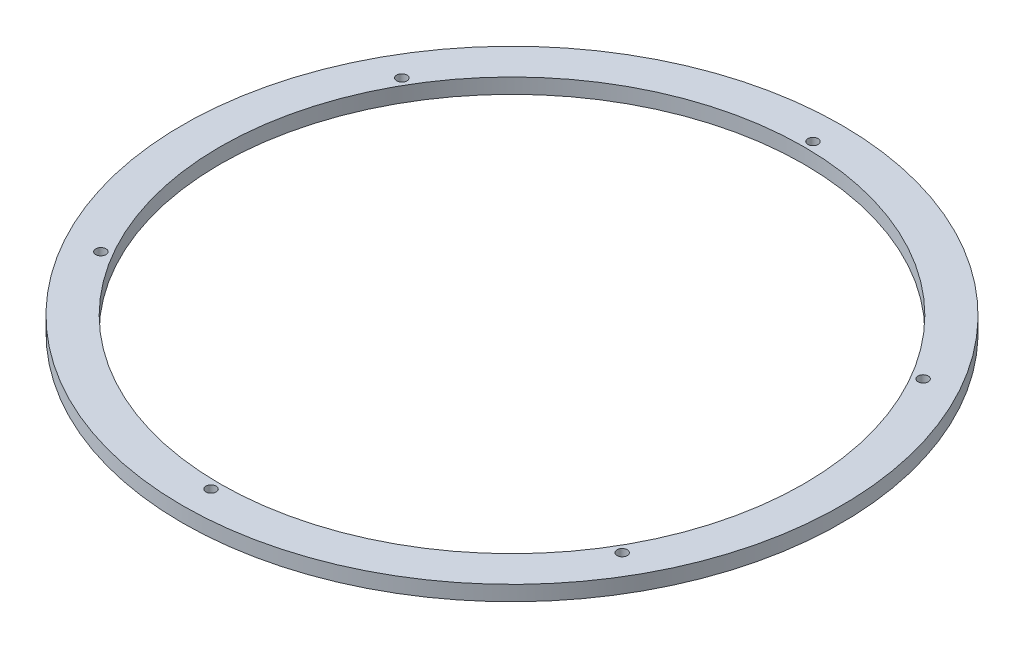
ISO-10303-21;
HEADER;
FILE_DESCRIPTION(('STEP AP214'),'2;1');
FILE_NAME('part.step','',(''),(''),'','','');
FILE_SCHEMA(('AUTOMOTIVE_DESIGN { 1 0 10303 214 1 1 1 1 }'));
ENDSEC;
DATA;
#1=APPLICATION_CONTEXT('core data for automotive mechanical design processes');
#2=APPLICATION_PROTOCOL_DEFINITION('international standard','automotive_design',2000,#1);
#3=PRODUCT_CONTEXT('',#1,'mechanical');
#4=PRODUCT('Part','Part','',(#3));
#5=PRODUCT_RELATED_PRODUCT_CATEGORY('part','',(#4));
#6=PRODUCT_DEFINITION_FORMATION('','',#4);
#7=PRODUCT_DEFINITION_CONTEXT('part definition',#1,'design');
#8=PRODUCT_DEFINITION('design','',#6,#7);
#9=PRODUCT_DEFINITION_SHAPE('','',#8);
#10=(LENGTH_UNIT() NAMED_UNIT(*) SI_UNIT(.MILLI.,.METRE.));
#11=(NAMED_UNIT(*) PLANE_ANGLE_UNIT() SI_UNIT($,.RADIAN.));
#12=(NAMED_UNIT(*) SI_UNIT($,.STERADIAN.) SOLID_ANGLE_UNIT());
#13=UNCERTAINTY_MEASURE_WITH_UNIT(LENGTH_MEASURE(1.E-05),#10,'distance_accuracy_value','');
#14=(GEOMETRIC_REPRESENTATION_CONTEXT(3) GLOBAL_UNCERTAINTY_ASSIGNED_CONTEXT((#13)) GLOBAL_UNIT_ASSIGNED_CONTEXT((#10,
#11,#12)) REPRESENTATION_CONTEXT('',''));
#15=CARTESIAN_POINT('',(0.,0.,0.));
#16=DIRECTION('',(0.,0.,1.));
#17=DIRECTION('',(1.,0.,0.));
#18=AXIS2_PLACEMENT_3D('',#15,#16,#17);
#19=CARTESIAN_POINT('',(0.,5.08,0.));
#20=DIRECTION('',(0.,1.,0.));
#21=DIRECTION('',(0.,0.,1.));
#22=AXIS2_PLACEMENT_3D('',#19,#20,#21);
#23=PLANE('',#22);
#24=CARTESIAN_POINT('',(-87.9881810244983,5.08,-50.800000000001));
#25=DIRECTION('',(0.,1.,0.));
#26=DIRECTION('',(0.,0.,1.));
#27=AXIS2_PLACEMENT_3D('',#24,#25,#26);
#28=CIRCLE('',#27,1.7272);
#29=CARTESIAN_POINT('',(-87.9881810244983,5.08,-49.072800000001));
#30=VERTEX_POINT('',#29);
#31=EDGE_CURVE('E99',#30,#30,#28,.T.);
#32=ORIENTED_EDGE('',*,*,#31,.F.);
#33=EDGE_LOOP('',(#32));
#34=FACE_BOUND('',#33,.T.);
#35=CARTESIAN_POINT('',(1.11022302462516E-13,5.08,-101.6));
#36=DIRECTION('',(0.,1.,0.));
#37=DIRECTION('',(0.,0.,1.));
#38=AXIS2_PLACEMENT_3D('',#35,#36,#37);
#39=CIRCLE('',#38,1.7272);
#40=CARTESIAN_POINT('',(1.11022302462516E-13,5.08,-99.8728000000001));
#41=VERTEX_POINT('',#40);
#42=EDGE_CURVE('E103',#41,#41,#39,.T.);
#43=ORIENTED_EDGE('',*,*,#42,.F.);
#44=EDGE_LOOP('',(#43));
#45=FACE_BOUND('',#44,.T.);
#46=CARTESIAN_POINT('',(87.9881810244992,5.08,-50.7999999999998));
#47=DIRECTION('',(0.,1.,0.));
#48=DIRECTION('',(0.,0.,1.));
#49=AXIS2_PLACEMENT_3D('',#46,#47,#48);
#50=CIRCLE('',#49,1.7272);
#51=CARTESIAN_POINT('',(87.9881810244992,5.08,-49.0727999999998));
#52=VERTEX_POINT('',#51);
#53=EDGE_CURVE('E107',#52,#52,#50,.T.);
#54=ORIENTED_EDGE('',*,*,#53,.F.);
#55=EDGE_LOOP('',(#54));
#56=FACE_BOUND('',#55,.T.);
#57=CARTESIAN_POINT('',(87.9881810244989,5.08,50.8000000000004));
#58=DIRECTION('',(0.,1.,0.));
#59=DIRECTION('',(0.,0.,1.));
#60=AXIS2_PLACEMENT_3D('',#57,#58,#59);
#61=CIRCLE('',#60,1.7272);
#62=CARTESIAN_POINT('',(87.9881810244989,5.08,52.5272000000004));
#63=VERTEX_POINT('',#62);
#64=EDGE_CURVE('E64',#63,#63,#61,.T.);
#65=ORIENTED_EDGE('',*,*,#64,.F.);
#66=EDGE_LOOP('',(#65));
#67=FACE_BOUND('',#66,.T.);
#68=CARTESIAN_POINT('',(1.11022302462516E-13,5.08,101.6));
#69=DIRECTION('',(0.,1.,0.));
#70=DIRECTION('',(0.,0.,1.));
#71=AXIS2_PLACEMENT_3D('',#68,#69,#70);
#72=CIRCLE('',#71,1.7272);
#73=CARTESIAN_POINT('',(1.11022302462516E-13,5.08,103.3272));
#74=VERTEX_POINT('',#73);
#75=EDGE_CURVE('E53',#74,#74,#72,.T.);
#76=ORIENTED_EDGE('',*,*,#75,.F.);
#77=EDGE_LOOP('',(#76));
#78=FACE_BOUND('',#77,.T.);
#79=CARTESIAN_POINT('',(-87.9881810244993,5.08,50.7999999999992));
#80=DIRECTION('',(0.,1.,0.));
#81=DIRECTION('',(0.,0.,1.));
#82=AXIS2_PLACEMENT_3D('',#79,#80,#81);
#83=CIRCLE('',#82,1.7272);
#84=CARTESIAN_POINT('',(-87.9881810244993,5.08,52.5271999999992));
#85=VERTEX_POINT('',#84);
#86=EDGE_CURVE('E52',#85,#85,#83,.T.);
#87=ORIENTED_EDGE('',*,*,#86,.F.);
#88=EDGE_LOOP('',(#87));
#89=FACE_BOUND('',#88,.T.);
#90=CARTESIAN_POINT('',(0.,5.08,0.));
#91=DIRECTION('',(0.,1.,0.));
#92=DIRECTION('',(0.,0.,1.));
#93=AXIS2_PLACEMENT_3D('',#90,#91,#92);
#94=CIRCLE('',#93,111.252);
#95=CARTESIAN_POINT('',(0.,5.08,111.252));
#96=VERTEX_POINT('',#95);
#97=EDGE_CURVE('E10',#96,#96,#94,.T.);
#98=ORIENTED_EDGE('',*,*,#97,.T.);
#99=EDGE_LOOP('',(#98));
#100=FACE_BOUND('',#99,.T.);
#101=CARTESIAN_POINT('',(0.,5.08,0.));
#102=DIRECTION('',(0.,1.,0.));
#103=DIRECTION('',(0.,0.,1.));
#104=AXIS2_PLACEMENT_3D('',#101,#102,#103);
#105=CIRCLE('',#104,98.552);
#106=CARTESIAN_POINT('',(0.,5.08,98.552));
#107=VERTEX_POINT('',#106);
#108=EDGE_CURVE('E45',#107,#107,#105,.T.);
#109=ORIENTED_EDGE('',*,*,#108,.F.);
#110=EDGE_LOOP('',(#109));
#111=FACE_BOUND('',#110,.T.);
#112=ADVANCED_FACE('F32',(#34,#45,#56,#67,#78,#89,#100,#111),#23,.T.);
#113=CARTESIAN_POINT('',(0.,0.,0.));
#114=DIRECTION('',(0.,1.,0.));
#115=DIRECTION('',(0.,0.,1.));
#116=AXIS2_PLACEMENT_3D('',#113,#114,#115);
#117=PLANE('',#116);
#118=CARTESIAN_POINT('',(-87.9881810244983,0.,-50.800000000001));
#119=DIRECTION('',(0.,1.,0.));
#120=DIRECTION('',(0.,0.,1.));
#121=AXIS2_PLACEMENT_3D('',#118,#119,#120);
#122=CIRCLE('',#121,1.7272);
#123=CARTESIAN_POINT('',(-87.9881810244983,0.,-49.072800000001));
#124=VERTEX_POINT('',#123);
#125=EDGE_CURVE('E131',#124,#124,#122,.T.);
#126=ORIENTED_EDGE('',*,*,#125,.T.);
#127=EDGE_LOOP('',(#126));
#128=FACE_BOUND('',#127,.T.);
#129=CARTESIAN_POINT('',(1.11022302462516E-13,0.,-101.6));
#130=DIRECTION('',(0.,1.,0.));
#131=DIRECTION('',(0.,0.,1.));
#132=AXIS2_PLACEMENT_3D('',#129,#130,#131);
#133=CIRCLE('',#132,1.7272);
#134=CARTESIAN_POINT('',(1.11022302462516E-13,0.,-99.8728000000001));
#135=VERTEX_POINT('',#134);
#136=EDGE_CURVE('E125',#135,#135,#133,.T.);
#137=ORIENTED_EDGE('',*,*,#136,.T.);
#138=EDGE_LOOP('',(#137));
#139=FACE_BOUND('',#138,.T.);
#140=CARTESIAN_POINT('',(87.9881810244992,0.,-50.7999999999998));
#141=DIRECTION('',(0.,1.,0.));
#142=DIRECTION('',(0.,0.,1.));
#143=AXIS2_PLACEMENT_3D('',#140,#141,#142);
#144=CIRCLE('',#143,1.7272);
#145=CARTESIAN_POINT('',(87.9881810244992,0.,-49.0727999999998));
#146=VERTEX_POINT('',#145);
#147=EDGE_CURVE('E121',#146,#146,#144,.T.);
#148=ORIENTED_EDGE('',*,*,#147,.T.);
#149=EDGE_LOOP('',(#148));
#150=FACE_BOUND('',#149,.T.);
#151=CARTESIAN_POINT('',(87.9881810244989,0.,50.8000000000004));
#152=DIRECTION('',(0.,1.,0.));
#153=DIRECTION('',(0.,0.,1.));
#154=AXIS2_PLACEMENT_3D('',#151,#152,#153);
#155=CIRCLE('',#154,1.7272);
#156=CARTESIAN_POINT('',(87.9881810244989,0.,52.5272000000004));
#157=VERTEX_POINT('',#156);
#158=EDGE_CURVE('E36',#157,#157,#155,.T.);
#159=ORIENTED_EDGE('',*,*,#158,.T.);
#160=EDGE_LOOP('',(#159));
#161=FACE_BOUND('',#160,.T.);
#162=CARTESIAN_POINT('',(1.11022302462516E-13,0.,101.6));
#163=DIRECTION('',(0.,1.,0.));
#164=DIRECTION('',(0.,0.,1.));
#165=AXIS2_PLACEMENT_3D('',#162,#163,#164);
#166=CIRCLE('',#165,1.7272);
#167=CARTESIAN_POINT('',(1.11022302462516E-13,0.,103.3272));
#168=VERTEX_POINT('',#167);
#169=EDGE_CURVE('E50',#168,#168,#166,.T.);
#170=ORIENTED_EDGE('',*,*,#169,.T.);
#171=EDGE_LOOP('',(#170));
#172=FACE_BOUND('',#171,.T.);
#173=CARTESIAN_POINT('',(-87.9881810244993,0.,50.7999999999992));
#174=DIRECTION('',(0.,1.,0.));
#175=DIRECTION('',(0.,0.,1.));
#176=AXIS2_PLACEMENT_3D('',#173,#174,#175);
#177=CIRCLE('',#176,1.7272);
#178=CARTESIAN_POINT('',(-87.9881810244993,0.,52.5271999999992));
#179=VERTEX_POINT('',#178);
#180=EDGE_CURVE('E57',#179,#179,#177,.T.);
#181=ORIENTED_EDGE('',*,*,#180,.T.);
#182=EDGE_LOOP('',(#181));
#183=FACE_BOUND('',#182,.T.);
#184=CARTESIAN_POINT('',(0.,0.,0.));
#185=DIRECTION('',(0.,1.,0.));
#186=DIRECTION('',(0.,0.,1.));
#187=AXIS2_PLACEMENT_3D('',#184,#185,#186);
#188=CIRCLE('',#187,111.252);
#189=CARTESIAN_POINT('',(0.,0.,111.252));
#190=VERTEX_POINT('',#189);
#191=EDGE_CURVE('E40',#190,#190,#188,.T.);
#192=ORIENTED_EDGE('',*,*,#191,.F.);
#193=EDGE_LOOP('',(#192));
#194=FACE_BOUND('',#193,.T.);
#195=CARTESIAN_POINT('',(0.,0.,0.));
#196=DIRECTION('',(0.,1.,0.));
#197=DIRECTION('',(0.,0.,1.));
#198=AXIS2_PLACEMENT_3D('',#195,#196,#197);
#199=CIRCLE('',#198,98.552);
#200=CARTESIAN_POINT('',(0.,0.,98.552));
#201=VERTEX_POINT('',#200);
#202=EDGE_CURVE('E48',#201,#201,#199,.T.);
#203=ORIENTED_EDGE('',*,*,#202,.T.);
#204=EDGE_LOOP('',(#203));
#205=FACE_BOUND('',#204,.T.);
#206=ADVANCED_FACE('F75',(#128,#139,#150,#161,#172,#183,#194,#205),#117,.F.);
#207=CARTESIAN_POINT('',(0.,5.08,0.));
#208=DIRECTION('',(0.,-1.,0.));
#209=DIRECTION('',(0.,0.,-1.));
#210=AXIS2_PLACEMENT_3D('',#207,#208,#209);
#211=CYLINDRICAL_SURFACE('',#210,111.252);
#212=ORIENTED_EDGE('',*,*,#97,.F.);
#213=EDGE_LOOP('',(#212));
#214=FACE_BOUND('',#213,.T.);
#215=ORIENTED_EDGE('',*,*,#191,.T.);
#216=EDGE_LOOP('',(#215));
#217=FACE_BOUND('',#216,.T.);
#218=ADVANCED_FACE('F34',(#214,#217),#211,.T.);
#219=CARTESIAN_POINT('',(0.,5.08,0.));
#220=DIRECTION('',(0.,-1.,0.));
#221=DIRECTION('',(0.,0.,-1.));
#222=AXIS2_PLACEMENT_3D('',#219,#220,#221);
#223=CYLINDRICAL_SURFACE('',#222,98.552);
#224=ORIENTED_EDGE('',*,*,#108,.T.);
#225=EDGE_LOOP('',(#224));
#226=FACE_BOUND('',#225,.T.);
#227=ORIENTED_EDGE('',*,*,#202,.F.);
#228=EDGE_LOOP('',(#227));
#229=FACE_BOUND('',#228,.T.);
#230=ADVANCED_FACE('F77',(#226,#229),#223,.F.);
#231=CARTESIAN_POINT('',(-87.9881810244993,5.08,50.7999999999992));
#232=DIRECTION('',(0.,1.,0.));
#233=DIRECTION('',(0.,0.,1.));
#234=AXIS2_PLACEMENT_3D('',#231,#232,#233);
#235=CYLINDRICAL_SURFACE('',#234,1.7272);
#236=ORIENTED_EDGE('',*,*,#86,.T.);
#237=EDGE_LOOP('',(#236));
#238=FACE_BOUND('',#237,.T.);
#239=ORIENTED_EDGE('',*,*,#180,.F.);
#240=EDGE_LOOP('',(#239));
#241=FACE_BOUND('',#240,.T.);
#242=ADVANCED_FACE('F79',(#238,#241),#235,.F.);
#243=CARTESIAN_POINT('',(1.11022302462516E-13,5.08,101.6));
#244=DIRECTION('',(0.,1.,0.));
#245=DIRECTION('',(0.,0.,1.));
#246=AXIS2_PLACEMENT_3D('',#243,#244,#245);
#247=CYLINDRICAL_SURFACE('',#246,1.7272);
#248=ORIENTED_EDGE('',*,*,#75,.T.);
#249=EDGE_LOOP('',(#248));
#250=FACE_BOUND('',#249,.T.);
#251=ORIENTED_EDGE('',*,*,#169,.F.);
#252=EDGE_LOOP('',(#251));
#253=FACE_BOUND('',#252,.T.);
#254=ADVANCED_FACE('F85',(#250,#253),#247,.F.);
#255=CARTESIAN_POINT('',(87.9881810244989,5.08,50.8000000000004));
#256=DIRECTION('',(0.,1.,0.));
#257=DIRECTION('',(0.,0.,1.));
#258=AXIS2_PLACEMENT_3D('',#255,#256,#257);
#259=CYLINDRICAL_SURFACE('',#258,1.7272);
#260=ORIENTED_EDGE('',*,*,#64,.T.);
#261=EDGE_LOOP('',(#260));
#262=FACE_BOUND('',#261,.T.);
#263=ORIENTED_EDGE('',*,*,#158,.F.);
#264=EDGE_LOOP('',(#263));
#265=FACE_BOUND('',#264,.T.);
#266=ADVANCED_FACE('F146',(#262,#265),#259,.F.);
#267=CARTESIAN_POINT('',(87.9881810244992,5.08,-50.7999999999998));
#268=DIRECTION('',(0.,1.,0.));
#269=DIRECTION('',(0.,0.,1.));
#270=AXIS2_PLACEMENT_3D('',#267,#268,#269);
#271=CYLINDRICAL_SURFACE('',#270,1.7272);
#272=ORIENTED_EDGE('',*,*,#53,.T.);
#273=EDGE_LOOP('',(#272));
#274=FACE_BOUND('',#273,.T.);
#275=ORIENTED_EDGE('',*,*,#147,.F.);
#276=EDGE_LOOP('',(#275));
#277=FACE_BOUND('',#276,.T.);
#278=ADVANCED_FACE('F148',(#274,#277),#271,.F.);
#279=CARTESIAN_POINT('',(1.11022302462516E-13,5.08,-101.6));
#280=DIRECTION('',(0.,1.,0.));
#281=DIRECTION('',(0.,0.,1.));
#282=AXIS2_PLACEMENT_3D('',#279,#280,#281);
#283=CYLINDRICAL_SURFACE('',#282,1.7272);
#284=ORIENTED_EDGE('',*,*,#42,.T.);
#285=EDGE_LOOP('',(#284));
#286=FACE_BOUND('',#285,.T.);
#287=ORIENTED_EDGE('',*,*,#136,.F.);
#288=EDGE_LOOP('',(#287));
#289=FACE_BOUND('',#288,.T.);
#290=ADVANCED_FACE('F138',(#286,#289),#283,.F.);
#291=CARTESIAN_POINT('',(-87.9881810244983,5.08,-50.800000000001));
#292=DIRECTION('',(0.,1.,0.));
#293=DIRECTION('',(0.,0.,1.));
#294=AXIS2_PLACEMENT_3D('',#291,#292,#293);
#295=CYLINDRICAL_SURFACE('',#294,1.7272);
#296=ORIENTED_EDGE('',*,*,#31,.T.);
#297=EDGE_LOOP('',(#296));
#298=FACE_BOUND('',#297,.T.);
#299=ORIENTED_EDGE('',*,*,#125,.F.);
#300=EDGE_LOOP('',(#299));
#301=FACE_BOUND('',#300,.T.);
#302=ADVANCED_FACE('F135',(#298,#301),#295,.F.);
#303=CLOSED_SHELL('',(#112,#206,#218,#230,#242,#254,#266,#278,#290,#302));
#304=MANIFOLD_SOLID_BREP('B2',#303);
#305=ADVANCED_BREP_SHAPE_REPRESENTATION('',(#18,#304),#14);
#306=SHAPE_DEFINITION_REPRESENTATION(#9,#305);
ENDSEC;
END-ISO-10303-21;
